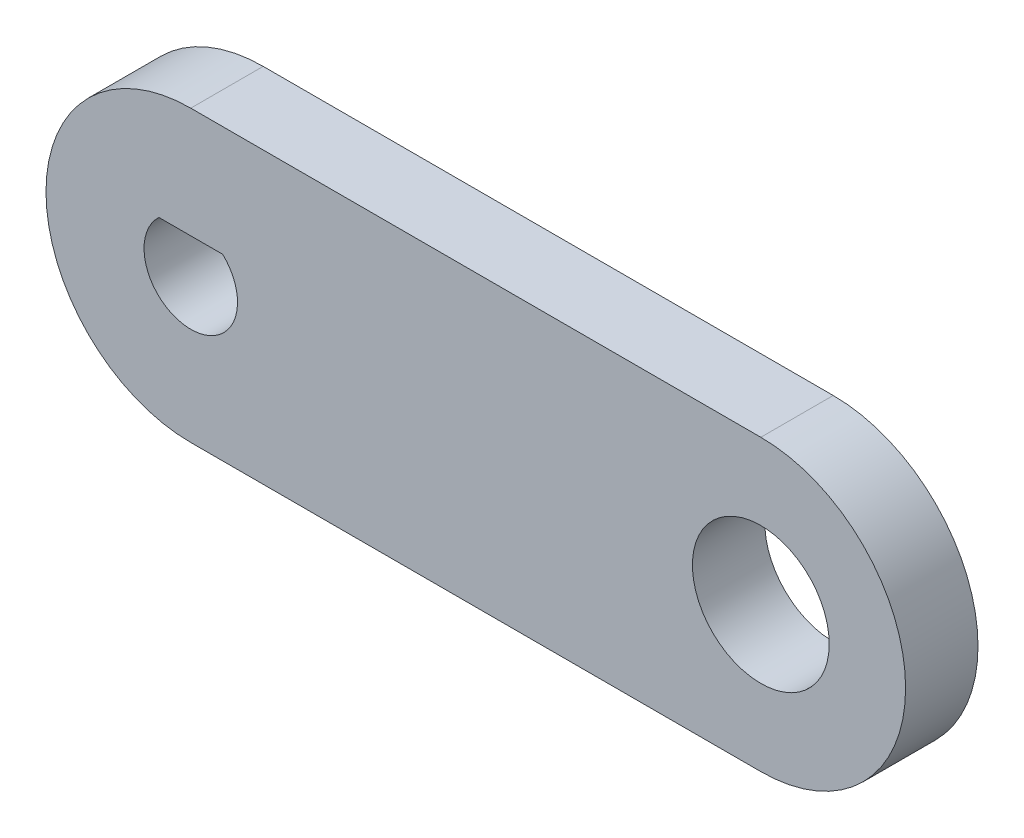
ISO-10303-21;
HEADER;
FILE_DESCRIPTION(('STEP AP214'),'2;1');
FILE_NAME('part.step','',(''),(''),'','','');
FILE_SCHEMA(('AUTOMOTIVE_DESIGN { 1 0 10303 214 1 1 1 1 }'));
ENDSEC;
DATA;
#1=APPLICATION_CONTEXT('core data for automotive mechanical design processes');
#2=APPLICATION_PROTOCOL_DEFINITION('international standard','automotive_design',2000,#1);
#3=PRODUCT_CONTEXT('',#1,'mechanical');
#4=PRODUCT('Part','Part','',(#3));
#5=PRODUCT_RELATED_PRODUCT_CATEGORY('part','',(#4));
#6=PRODUCT_DEFINITION_FORMATION('','',#4);
#7=PRODUCT_DEFINITION_CONTEXT('part definition',#1,'design');
#8=PRODUCT_DEFINITION('design','',#6,#7);
#9=PRODUCT_DEFINITION_SHAPE('','',#8);
#10=(LENGTH_UNIT() NAMED_UNIT(*) SI_UNIT(.MILLI.,.METRE.));
#11=(NAMED_UNIT(*) PLANE_ANGLE_UNIT() SI_UNIT($,.RADIAN.));
#12=(NAMED_UNIT(*) SI_UNIT($,.STERADIAN.) SOLID_ANGLE_UNIT());
#13=UNCERTAINTY_MEASURE_WITH_UNIT(LENGTH_MEASURE(1.E-05),#10,'distance_accuracy_value','');
#14=(GEOMETRIC_REPRESENTATION_CONTEXT(3) GLOBAL_UNCERTAINTY_ASSIGNED_CONTEXT((#13)) GLOBAL_UNIT_ASSIGNED_CONTEXT((#10,
#11,#12)) REPRESENTATION_CONTEXT('',''));
#15=CARTESIAN_POINT('',(0.,0.,0.));
#16=DIRECTION('',(0.,0.,1.));
#17=DIRECTION('',(1.,0.,0.));
#18=AXIS2_PLACEMENT_3D('',#15,#16,#17);
#19=CARTESIAN_POINT('',(25.,0.,-3.175));
#20=DIRECTION('',(0.,0.,1.));
#21=DIRECTION('',(1.,0.,0.));
#22=AXIS2_PLACEMENT_3D('',#19,#20,#21);
#23=CYLINDRICAL_SURFACE('',#22,6.35);
#24=CARTESIAN_POINT('',(25.,0.,0.));
#25=DIRECTION('',(0.,0.,1.));
#26=DIRECTION('',(1.,0.,0.));
#27=AXIS2_PLACEMENT_3D('',#24,#25,#26);
#28=CIRCLE('',#27,6.35);
#29=CARTESIAN_POINT('',(25.,-6.35,0.));
#30=VERTEX_POINT('',#29);
#31=CARTESIAN_POINT('',(25.,6.35,0.));
#32=VERTEX_POINT('',#31);
#33=EDGE_CURVE('E105',#30,#32,#28,.T.);
#34=ORIENTED_EDGE('',*,*,#33,.F.);
#35=DIRECTION('',(0.,0.,1.));
#36=VECTOR('',#35,1.);
#37=CARTESIAN_POINT('',(25.,-6.35,-3.175));
#38=LINE('',#37,#36);
#39=CARTESIAN_POINT('',(25.,-6.35,-3.175));
#40=VERTEX_POINT('',#39);
#41=EDGE_CURVE('E11',#40,#30,#38,.T.);
#42=ORIENTED_EDGE('',*,*,#41,.F.);
#43=CARTESIAN_POINT('',(25.,0.,-3.175));
#44=DIRECTION('',(0.,0.,1.));
#45=DIRECTION('',(1.,0.,0.));
#46=AXIS2_PLACEMENT_3D('',#43,#44,#45);
#47=CIRCLE('',#46,6.35);
#48=CARTESIAN_POINT('',(25.,6.35,-3.175));
#49=VERTEX_POINT('',#48);
#50=EDGE_CURVE('E107',#40,#49,#47,.T.);
#51=ORIENTED_EDGE('',*,*,#50,.T.);
#52=DIRECTION('',(0.,0.,1.));
#53=VECTOR('',#52,1.);
#54=CARTESIAN_POINT('',(25.,6.35,-3.175));
#55=LINE('',#54,#53);
#56=EDGE_CURVE('E35',#49,#32,#55,.T.);
#57=ORIENTED_EDGE('',*,*,#56,.T.);
#58=EDGE_LOOP('',(#34,#42,#51,#57));
#59=FACE_BOUND('',#58,.T.);
#60=ADVANCED_FACE('F32',(#59),#23,.T.);
#61=CARTESIAN_POINT('',(0.,-6.35,-3.175));
#62=DIRECTION('',(0.,-1.,0.));
#63=DIRECTION('',(1.,0.,0.));
#64=AXIS2_PLACEMENT_3D('',#61,#62,#63);
#65=PLANE('',#64);
#66=DIRECTION('',(1.,0.,0.));
#67=VECTOR('',#66,1.);
#68=CARTESIAN_POINT('',(0.,-6.35,0.));
#69=LINE('',#68,#67);
#70=CARTESIAN_POINT('',(0.,-6.35,0.));
#71=VERTEX_POINT('',#70);
#72=EDGE_CURVE('E111',#71,#30,#69,.T.);
#73=ORIENTED_EDGE('',*,*,#72,.F.);
#74=DIRECTION('',(0.,0.,1.));
#75=VECTOR('',#74,1.);
#76=CARTESIAN_POINT('',(0.,-6.35,-3.175));
#77=LINE('',#76,#75);
#78=CARTESIAN_POINT('',(0.,-6.35,-3.175));
#79=VERTEX_POINT('',#78);
#80=EDGE_CURVE('E40',#79,#71,#77,.T.);
#81=ORIENTED_EDGE('',*,*,#80,.F.);
#82=DIRECTION('',(1.,0.,0.));
#83=VECTOR('',#82,1.);
#84=CARTESIAN_POINT('',(0.,-6.35,-3.175));
#85=LINE('',#84,#83);
#86=EDGE_CURVE('E117',#79,#40,#85,.T.);
#87=ORIENTED_EDGE('',*,*,#86,.T.);
#88=ORIENTED_EDGE('',*,*,#41,.T.);
#89=EDGE_LOOP('',(#73,#81,#87,#88));
#90=FACE_BOUND('',#89,.T.);
#91=ADVANCED_FACE('F143',(#90),#65,.T.);
#92=CARTESIAN_POINT('',(0.,0.,-3.175));
#93=DIRECTION('',(0.,0.,1.));
#94=DIRECTION('',(1.,0.,0.));
#95=AXIS2_PLACEMENT_3D('',#92,#93,#94);
#96=CYLINDRICAL_SURFACE('',#95,6.35);
#97=CARTESIAN_POINT('',(0.,0.,0.));
#98=DIRECTION('',(0.,0.,1.));
#99=DIRECTION('',(1.,0.,0.));
#100=AXIS2_PLACEMENT_3D('',#97,#98,#99);
#101=CIRCLE('',#100,6.35);
#102=CARTESIAN_POINT('',(0.,6.35,0.));
#103=VERTEX_POINT('',#102);
#104=EDGE_CURVE('E125',#103,#71,#101,.T.);
#105=ORIENTED_EDGE('',*,*,#104,.F.);
#106=DIRECTION('',(0.,0.,1.));
#107=VECTOR('',#106,1.);
#108=CARTESIAN_POINT('',(0.,6.35,-3.175));
#109=LINE('',#108,#107);
#110=CARTESIAN_POINT('',(0.,6.35,-3.175));
#111=VERTEX_POINT('',#110);
#112=EDGE_CURVE('E130',#111,#103,#109,.T.);
#113=ORIENTED_EDGE('',*,*,#112,.F.);
#114=CARTESIAN_POINT('',(0.,0.,-3.175));
#115=DIRECTION('',(0.,0.,1.));
#116=DIRECTION('',(1.,0.,0.));
#117=AXIS2_PLACEMENT_3D('',#114,#115,#116);
#118=CIRCLE('',#117,6.35);
#119=EDGE_CURVE('E114',#111,#79,#118,.T.);
#120=ORIENTED_EDGE('',*,*,#119,.T.);
#121=ORIENTED_EDGE('',*,*,#80,.T.);
#122=EDGE_LOOP('',(#105,#113,#120,#121));
#123=FACE_BOUND('',#122,.T.);
#124=ADVANCED_FACE('F147',(#123),#96,.T.);
#125=CARTESIAN_POINT('',(25.,6.35,-3.175));
#126=DIRECTION('',(0.,1.,0.));
#127=DIRECTION('',(-1.,0.,0.));
#128=AXIS2_PLACEMENT_3D('',#125,#126,#127);
#129=PLANE('',#128);
#130=DIRECTION('',(-1.,0.,0.));
#131=VECTOR('',#130,1.);
#132=CARTESIAN_POINT('',(25.,6.35,0.));
#133=LINE('',#132,#131);
#134=EDGE_CURVE('E122',#32,#103,#133,.T.);
#135=ORIENTED_EDGE('',*,*,#134,.F.);
#136=ORIENTED_EDGE('',*,*,#56,.F.);
#137=DIRECTION('',(-1.,0.,0.));
#138=VECTOR('',#137,1.);
#139=CARTESIAN_POINT('',(25.,6.35,-3.175));
#140=LINE('',#139,#138);
#141=EDGE_CURVE('E110',#49,#111,#140,.T.);
#142=ORIENTED_EDGE('',*,*,#141,.T.);
#143=ORIENTED_EDGE('',*,*,#112,.T.);
#144=EDGE_LOOP('',(#135,#136,#142,#143));
#145=FACE_BOUND('',#144,.T.);
#146=ADVANCED_FACE('F138',(#145),#129,.T.);
#147=CARTESIAN_POINT('',(25.,0.,-3.175));
#148=DIRECTION('',(0.,0.,1.));
#149=DIRECTION('',(1.,0.,0.));
#150=AXIS2_PLACEMENT_3D('',#147,#148,#149);
#151=PLANE('',#150);
#152=CARTESIAN_POINT('',(25.,0.,-3.175));
#153=DIRECTION('',(0.,0.,1.));
#154=DIRECTION('',(1.,0.,0.));
#155=AXIS2_PLACEMENT_3D('',#152,#153,#154);
#156=CIRCLE('',#155,3.);
#157=CARTESIAN_POINT('',(28.,0.,-3.175));
#158=VERTEX_POINT('',#157);
#159=EDGE_CURVE('E103',#158,#158,#156,.T.);
#160=ORIENTED_EDGE('',*,*,#159,.T.);
#161=EDGE_LOOP('',(#160));
#162=FACE_BOUND('',#161,.T.);
#163=DIRECTION('',(-1.,0.,0.));
#164=VECTOR('',#163,1.);
#165=CARTESIAN_POINT('',(-1.39731886124821,1.5,-3.175));
#166=LINE('',#165,#164);
#167=CARTESIAN_POINT('',(1.39731886124821,1.5,-3.175));
#168=VERTEX_POINT('',#167);
#169=CARTESIAN_POINT('',(-1.39731886124821,1.5,-3.175));
#170=VERTEX_POINT('',#169);
#171=EDGE_CURVE('E88',#168,#170,#166,.T.);
#172=ORIENTED_EDGE('',*,*,#171,.T.);
#173=CARTESIAN_POINT('',(0.,0.,-3.175));
#174=DIRECTION('',(0.,0.,1.));
#175=DIRECTION('',(1.,0.,0.));
#176=AXIS2_PLACEMENT_3D('',#173,#174,#175);
#177=CIRCLE('',#176,2.05);
#178=EDGE_CURVE('E48',#170,#168,#177,.T.);
#179=ORIENTED_EDGE('',*,*,#178,.T.);
#180=EDGE_LOOP('',(#172,#179));
#181=FACE_BOUND('',#180,.T.);
#182=ORIENTED_EDGE('',*,*,#50,.F.);
#183=ORIENTED_EDGE('',*,*,#86,.F.);
#184=ORIENTED_EDGE('',*,*,#119,.F.);
#185=ORIENTED_EDGE('',*,*,#141,.F.);
#186=EDGE_LOOP('',(#182,#183,#184,#185));
#187=FACE_BOUND('',#186,.T.);
#188=ADVANCED_FACE('F94',(#162,#181,#187),#151,.F.);
#189=CARTESIAN_POINT('',(25.,0.,0.));
#190=DIRECTION('',(0.,0.,1.));
#191=DIRECTION('',(1.,0.,0.));
#192=AXIS2_PLACEMENT_3D('',#189,#190,#191);
#193=PLANE('',#192);
#194=CARTESIAN_POINT('',(25.,0.,0.));
#195=DIRECTION('',(0.,0.,1.));
#196=DIRECTION('',(1.,0.,0.));
#197=AXIS2_PLACEMENT_3D('',#194,#195,#196);
#198=CIRCLE('',#197,3.);
#199=CARTESIAN_POINT('',(28.,0.,0.));
#200=VERTEX_POINT('',#199);
#201=EDGE_CURVE('E100',#200,#200,#198,.T.);
#202=ORIENTED_EDGE('',*,*,#201,.F.);
#203=EDGE_LOOP('',(#202));
#204=FACE_BOUND('',#203,.T.);
#205=CARTESIAN_POINT('',(0.,0.,0.));
#206=DIRECTION('',(0.,0.,1.));
#207=DIRECTION('',(1.,0.,0.));
#208=AXIS2_PLACEMENT_3D('',#205,#206,#207);
#209=CIRCLE('',#208,2.05);
#210=CARTESIAN_POINT('',(-1.39731886124821,1.5,0.));
#211=VERTEX_POINT('',#210);
#212=CARTESIAN_POINT('',(1.39731886124821,1.5,0.));
#213=VERTEX_POINT('',#212);
#214=EDGE_CURVE('E53',#211,#213,#209,.T.);
#215=ORIENTED_EDGE('',*,*,#214,.F.);
#216=DIRECTION('',(-1.,0.,0.));
#217=VECTOR('',#216,1.);
#218=CARTESIAN_POINT('',(-1.39731886124821,1.5,0.));
#219=LINE('',#218,#217);
#220=EDGE_CURVE('E96',#213,#211,#219,.T.);
#221=ORIENTED_EDGE('',*,*,#220,.F.);
#222=EDGE_LOOP('',(#215,#221));
#223=FACE_BOUND('',#222,.T.);
#224=ORIENTED_EDGE('',*,*,#33,.T.);
#225=ORIENTED_EDGE('',*,*,#134,.T.);
#226=ORIENTED_EDGE('',*,*,#104,.T.);
#227=ORIENTED_EDGE('',*,*,#72,.T.);
#228=EDGE_LOOP('',(#224,#225,#226,#227));
#229=FACE_BOUND('',#228,.T.);
#230=ADVANCED_FACE('F140',(#204,#223,#229),#193,.T.);
#231=CARTESIAN_POINT('',(0.,0.,-3.175));
#232=DIRECTION('',(0.,0.,1.));
#233=DIRECTION('',(1.,0.,0.));
#234=AXIS2_PLACEMENT_3D('',#231,#232,#233);
#235=CYLINDRICAL_SURFACE('',#234,2.05);
#236=ORIENTED_EDGE('',*,*,#214,.T.);
#237=DIRECTION('',(0.,0.,1.));
#238=VECTOR('',#237,1.);
#239=CARTESIAN_POINT('',(1.39731886124821,1.5,-3.175));
#240=LINE('',#239,#238);
#241=EDGE_CURVE('E81',#168,#213,#240,.T.);
#242=ORIENTED_EDGE('',*,*,#241,.F.);
#243=ORIENTED_EDGE('',*,*,#178,.F.);
#244=DIRECTION('',(0.,0.,1.));
#245=VECTOR('',#244,1.);
#246=CARTESIAN_POINT('',(-1.39731886124821,1.5,-3.175));
#247=LINE('',#246,#245);
#248=EDGE_CURVE('E87',#170,#211,#247,.T.);
#249=ORIENTED_EDGE('',*,*,#248,.T.);
#250=EDGE_LOOP('',(#236,#242,#243,#249));
#251=FACE_BOUND('',#250,.T.);
#252=ADVANCED_FACE('F83',(#251),#235,.F.);
#253=CARTESIAN_POINT('',(-1.39731886124821,1.5,-3.175));
#254=DIRECTION('',(0.,1.,0.));
#255=DIRECTION('',(0.,0.,1.));
#256=AXIS2_PLACEMENT_3D('',#253,#254,#255);
#257=PLANE('',#256);
#258=ORIENTED_EDGE('',*,*,#220,.T.);
#259=ORIENTED_EDGE('',*,*,#248,.F.);
#260=ORIENTED_EDGE('',*,*,#171,.F.);
#261=ORIENTED_EDGE('',*,*,#241,.T.);
#262=EDGE_LOOP('',(#258,#259,#260,#261));
#263=FACE_BOUND('',#262,.T.);
#264=ADVANCED_FACE('F91',(#263),#257,.F.);
#265=CARTESIAN_POINT('',(25.,0.,-3.175));
#266=DIRECTION('',(0.,0.,1.));
#267=DIRECTION('',(1.,0.,0.));
#268=AXIS2_PLACEMENT_3D('',#265,#266,#267);
#269=CYLINDRICAL_SURFACE('',#268,3.);
#270=ORIENTED_EDGE('',*,*,#159,.F.);
#271=EDGE_LOOP('',(#270));
#272=FACE_BOUND('',#271,.T.);
#273=ORIENTED_EDGE('',*,*,#201,.T.);
#274=EDGE_LOOP('',(#273));
#275=FACE_BOUND('',#274,.T.);
#276=ADVANCED_FACE('F207',(#272,#275),#269,.F.);
#277=CLOSED_SHELL('',(#60,#91,#124,#146,#188,#230,#252,#264,#276));
#278=MANIFOLD_SOLID_BREP('B2',#277);
#279=ADVANCED_BREP_SHAPE_REPRESENTATION('',(#18,#278),#14);
#280=SHAPE_DEFINITION_REPRESENTATION(#9,#279);
ENDSEC;
END-ISO-10303-21;
